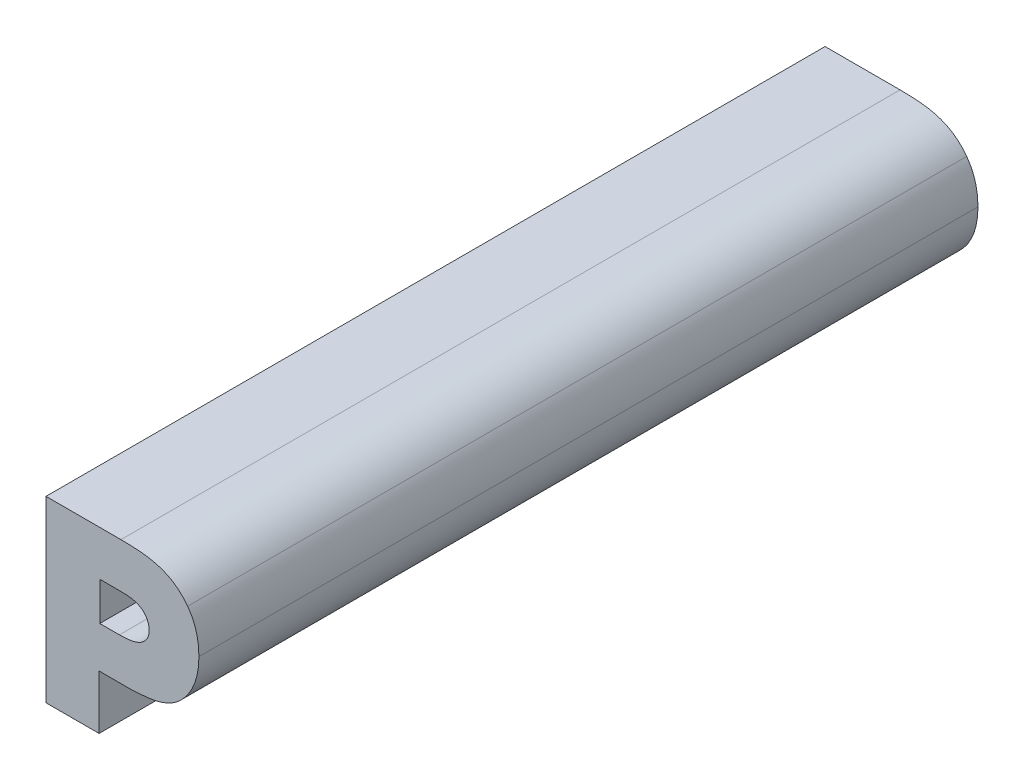
ISO-10303-21;
HEADER;
FILE_DESCRIPTION(('STEP AP214'),'2;1');
FILE_NAME('part.step','',(''),(''),'','','');
FILE_SCHEMA(('AUTOMOTIVE_DESIGN { 1 0 10303 214 1 1 1 1 }'));
ENDSEC;
DATA;
#1=APPLICATION_CONTEXT('core data for automotive mechanical design processes');
#2=APPLICATION_PROTOCOL_DEFINITION('international standard','automotive_design',2000,#1);
#3=PRODUCT_CONTEXT('',#1,'mechanical');
#4=PRODUCT('Part','Part','',(#3));
#5=PRODUCT_RELATED_PRODUCT_CATEGORY('part','',(#4));
#6=PRODUCT_DEFINITION_FORMATION('','',#4);
#7=PRODUCT_DEFINITION_CONTEXT('part definition',#1,'design');
#8=PRODUCT_DEFINITION('design','',#6,#7);
#9=PRODUCT_DEFINITION_SHAPE('','',#8);
#10=(LENGTH_UNIT() NAMED_UNIT(*) SI_UNIT(.MILLI.,.METRE.));
#11=(NAMED_UNIT(*) PLANE_ANGLE_UNIT() SI_UNIT($,.RADIAN.));
#12=(NAMED_UNIT(*) SI_UNIT($,.STERADIAN.) SOLID_ANGLE_UNIT());
#13=UNCERTAINTY_MEASURE_WITH_UNIT(LENGTH_MEASURE(1.E-05),#10,'distance_accuracy_value','');
#14=(GEOMETRIC_REPRESENTATION_CONTEXT(3) GLOBAL_UNCERTAINTY_ASSIGNED_CONTEXT((#13)) GLOBAL_UNIT_ASSIGNED_CONTEXT((#10,
#11,#12)) REPRESENTATION_CONTEXT('',''));
#15=CARTESIAN_POINT('',(0.,0.,0.));
#16=DIRECTION('',(0.,0.,1.));
#17=DIRECTION('',(1.,0.,0.));
#18=AXIS2_PLACEMENT_3D('',#15,#16,#17);
#19=CARTESIAN_POINT('',(1.3065440688273,0.0296655305136242,0.));
#20=DIRECTION('',(0.,-1.,0.));
#21=DIRECTION('',(1.,0.,0.));
#22=AXIS2_PLACEMENT_3D('',#19,#20,#21);
#23=PLANE('',#22);
#24=DIRECTION('',(1.,0.,0.));
#25=VECTOR('',#24,1.);
#26=CARTESIAN_POINT('',(1.3065592489997,0.0296655305136242,0.));
#27=LINE('',#26,#25);
#28=CARTESIAN_POINT('',(1.3065440688273,0.0296655305136242,0.));
#29=VERTEX_POINT('',#28);
#30=CARTESIAN_POINT('',(1.3090666836279,0.0296655305136242,0.));
#31=VERTEX_POINT('',#30);
#32=EDGE_CURVE('E11',#29,#31,#27,.T.);
#33=ORIENTED_EDGE('',*,*,#32,.F.);
#34=DIRECTION('',(0.,0.,1.));
#35=VECTOR('',#34,1.);
#36=CARTESIAN_POINT('',(1.3065440688273,0.0296655305136242,0.));
#37=LINE('',#36,#35);
#38=CARTESIAN_POINT('',(1.3065440688273,0.0296655305136242,0.1));
#39=VERTEX_POINT('',#38);
#40=EDGE_CURVE('E24',#29,#39,#37,.T.);
#41=ORIENTED_EDGE('',*,*,#40,.T.);
#42=DIRECTION('',(-1.,0.,0.));
#43=VECTOR('',#42,1.);
#44=CARTESIAN_POINT('',(1.3065592489997,0.0296655305136242,0.1));
#45=LINE('',#44,#43);
#46=CARTESIAN_POINT('',(1.3090666836279,0.0296655305136242,0.1));
#47=VERTEX_POINT('',#46);
#48=EDGE_CURVE('E342',#47,#39,#45,.T.);
#49=ORIENTED_EDGE('',*,*,#48,.F.);
#50=DIRECTION('',(0.,0.,1.));
#51=VECTOR('',#50,1.);
#52=CARTESIAN_POINT('',(1.3090666836279,0.0296655305136242,0.));
#53=LINE('',#52,#51);
#54=EDGE_CURVE('E339',#31,#47,#53,.T.);
#55=ORIENTED_EDGE('',*,*,#54,.F.);
#56=EDGE_LOOP('',(#33,#41,#49,#55));
#57=FACE_BOUND('',#56,.T.);
#58=ADVANCED_FACE('F17',(#57),#23,.F.);
#59=CARTESIAN_POINT('',(1.3065440688273,0.0345889686389742,0.));
#60=DIRECTION('',(-1.,0.,0.));
#61=DIRECTION('',(0.,-1.,0.));
#62=AXIS2_PLACEMENT_3D('',#59,#60,#61);
#63=PLANE('',#62);
#64=DIRECTION('',(0.,-1.,0.));
#65=VECTOR('',#64,1.);
#66=CARTESIAN_POINT('',(1.3065440688273,0.0319977137021068,0.));
#67=LINE('',#66,#65);
#68=CARTESIAN_POINT('',(1.3065440688273,0.0345889686389742,0.));
#69=VERTEX_POINT('',#68);
#70=EDGE_CURVE('E337',#69,#29,#67,.T.);
#71=ORIENTED_EDGE('',*,*,#70,.F.);
#72=DIRECTION('',(0.,0.,1.));
#73=VECTOR('',#72,1.);
#74=CARTESIAN_POINT('',(1.3065440688273,0.0345889686389742,0.));
#75=LINE('',#74,#73);
#76=CARTESIAN_POINT('',(1.3065440688273,0.0345889686389742,0.1));
#77=VERTEX_POINT('',#76);
#78=EDGE_CURVE('E335',#69,#77,#75,.T.);
#79=ORIENTED_EDGE('',*,*,#78,.T.);
#80=DIRECTION('',(0.,1.,0.));
#81=VECTOR('',#80,1.);
#82=CARTESIAN_POINT('',(1.3065440688273,0.0319977137021068,0.1));
#83=LINE('',#82,#81);
#84=EDGE_CURVE('E332',#39,#77,#83,.T.);
#85=ORIENTED_EDGE('',*,*,#84,.F.);
#86=ORIENTED_EDGE('',*,*,#40,.F.);
#87=EDGE_LOOP('',(#71,#79,#85,#86));
#88=FACE_BOUND('',#87,.T.);
#89=ADVANCED_FACE('F348',(#88),#63,.F.);
#90=CARTESIAN_POINT('',(1.3084287825669,0.0345889686389742,0.));
#91=DIRECTION('',(0.,1.,0.));
#92=DIRECTION('',(-1.,0.,0.));
#93=AXIS2_PLACEMENT_3D('',#90,#91,#92);
#94=PLANE('',#93);
#95=DIRECTION('',(-1.,0.,0.));
#96=VECTOR('',#95,1.);
#97=CARTESIAN_POINT('',(1.3075016058695,0.0345889686389742,0.));
#98=LINE('',#97,#96);
#99=CARTESIAN_POINT('',(1.3084287825669,0.0345889686389742,0.));
#100=VERTEX_POINT('',#99);
#101=EDGE_CURVE('E329',#100,#69,#98,.T.);
#102=ORIENTED_EDGE('',*,*,#101,.F.);
#103=DIRECTION('',(0.,0.,1.));
#104=VECTOR('',#103,1.);
#105=CARTESIAN_POINT('',(1.3084287825669,0.0345889686389742,0.));
#106=LINE('',#105,#104);
#107=CARTESIAN_POINT('',(1.3084287825669,0.0345889686389742,0.1));
#108=VERTEX_POINT('',#107);
#109=EDGE_CURVE('E327',#100,#108,#106,.T.);
#110=ORIENTED_EDGE('',*,*,#109,.T.);
#111=DIRECTION('',(1.,0.,0.));
#112=VECTOR('',#111,1.);
#113=CARTESIAN_POINT('',(1.3075016058695,0.0345889686389742,0.1));
#114=LINE('',#113,#112);
#115=EDGE_CURVE('E321',#77,#108,#114,.T.);
#116=ORIENTED_EDGE('',*,*,#115,.F.);
#117=ORIENTED_EDGE('',*,*,#78,.F.);
#118=EDGE_LOOP('',(#102,#110,#116,#117));
#119=FACE_BOUND('',#118,.T.);
#120=ADVANCED_FACE('F351',(#119),#94,.F.);
#121=CARTESIAN_POINT('',(1.3123141837369,0.0336408089062742,0.));
#122=CARTESIAN_POINT('',(1.3123141837369,0.0336408089062742,0.1));
#123=CARTESIAN_POINT('',(1.3113283357383,0.0347107441976205,0.));
#124=CARTESIAN_POINT('',(1.3113283357383,0.0347107441976205,0.1));
#125=CARTESIAN_POINT('',(1.3097335820909,0.0345889686389732,0.));
#126=CARTESIAN_POINT('',(1.3097335820909,0.0345889686389732,0.1));
#127=CARTESIAN_POINT('',(1.3084287825669,0.0345889686389742,0.));
#128=CARTESIAN_POINT('',(1.3084287825669,0.0345889686389742,0.1));
#129=B_SPLINE_SURFACE_WITH_KNOTS('',3,1,((#121,#122),(#123,#124),(#125,#126),(#127,#128)),
.UNSPECIFIED.,.F.,.F.,.F.,(4,4),(2,2),(0.,1.),(0.,0.01),.UNSPECIFIED.);
#130=CARTESIAN_POINT('',(1.3123141837369,0.0336408089062742,0.));
#131=CARTESIAN_POINT('',(1.3113283357383,0.0347107441976205,0.));
#132=CARTESIAN_POINT('',(1.3097335820909,0.0345889686389732,0.));
#133=CARTESIAN_POINT('',(1.3084287825669,0.0345889686389742,0.));
#134=B_SPLINE_CURVE_WITH_KNOTS('',3,(#130,#131,#132,#133),.UNSPECIFIED.,.F.,.F.,(4,4),(0.,1.),.UNSPECIFIED.);
#135=CARTESIAN_POINT('',(1.3123141837369,0.0336408089062742,0.));
#136=VERTEX_POINT('',#135);
#137=EDGE_CURVE('E316',#136,#100,#134,.T.);
#138=DIRECTION('',(0.,0.,1.));
#139=VECTOR('',#138,1.);
#140=CARTESIAN_POINT('',(1.3123141837369,0.0336408089062742,0.));
#141=LINE('',#140,#139);
#142=CARTESIAN_POINT('',(1.3123141837369,0.0336408089062742,0.1));
#143=VERTEX_POINT('',#142);
#144=EDGE_CURVE('E310',#136,#143,#141,.T.);
#145=CARTESIAN_POINT('',(1.3084287825669,0.0345889686389742,0.1));
#146=CARTESIAN_POINT('',(1.3097335820909,0.0345889686389732,0.1));
#147=CARTESIAN_POINT('',(1.3113283357383,0.0347107441976205,0.1));
#148=CARTESIAN_POINT('',(1.3123141837369,0.0336408089062742,0.1));
#149=B_SPLINE_CURVE_WITH_KNOTS('',3,(#145,#146,#147,#148),.UNSPECIFIED.,.F.,.F.,(4,4),(-1.,0.),.UNSPECIFIED.);
#150=EDGE_CURVE('E303',#108,#143,#149,.T.);
#151=ORIENTED_EDGE('',*,*,#137,.F.);
#152=ORIENTED_EDGE('',*,*,#144,.T.);
#153=ORIENTED_EDGE('',*,*,#150,.F.);
#154=ORIENTED_EDGE('',*,*,#109,.F.);
#155=EDGE_LOOP('',(#151,#152,#153,#154));
#156=FACE_BOUND('',#155,.T.);
#157=ADVANCED_FACE('F357',(#156),#129,.F.);
#158=CARTESIAN_POINT('',(1.3128940899939,0.0321127449062742,0.));
#159=CARTESIAN_POINT('',(1.3128940899939,0.0321127449062742,0.1));
#160=CARTESIAN_POINT('',(1.3128650925918,0.0329043218516245,0.));
#161=CARTESIAN_POINT('',(1.3128650925918,0.0329043218516245,0.1));
#162=CARTESIAN_POINT('',(1.3125171456542,0.0333972518199699,0.));
#163=CARTESIAN_POINT('',(1.3125171456542,0.0333972518199699,0.1));
#164=CARTESIAN_POINT('',(1.3123141837369,0.0336408089062742,0.));
#165=CARTESIAN_POINT('',(1.3123141837369,0.0336408089062742,0.1));
#166=B_SPLINE_SURFACE_WITH_KNOTS('',3,1,((#158,#159),(#160,#161),(#162,#163),(#164,#165)),
.UNSPECIFIED.,.F.,.F.,.F.,(4,4),(2,2),(0.,1.),(0.,0.01),.UNSPECIFIED.);
#167=CARTESIAN_POINT('',(1.3128940899939,0.0321127449062742,0.));
#168=CARTESIAN_POINT('',(1.3128650925918,0.0329043218516245,0.));
#169=CARTESIAN_POINT('',(1.3125171456542,0.0333972518199699,0.));
#170=CARTESIAN_POINT('',(1.3123141837369,0.0336408089062742,0.));
#171=B_SPLINE_CURVE_WITH_KNOTS('',3,(#167,#168,#169,#170),.UNSPECIFIED.,.F.,.F.,(4,4),(0.,1.),.UNSPECIFIED.);
#172=CARTESIAN_POINT('',(1.3128940899939,0.0321127449062742,0.));
#173=VERTEX_POINT('',#172);
#174=EDGE_CURVE('E298',#173,#136,#171,.T.);
#175=DIRECTION('',(0.,0.,1.));
#176=VECTOR('',#175,1.);
#177=CARTESIAN_POINT('',(1.3128940899939,0.0321127449062742,0.));
#178=LINE('',#177,#176);
#179=CARTESIAN_POINT('',(1.3128940899939,0.0321127449062742,0.1));
#180=VERTEX_POINT('',#179);
#181=EDGE_CURVE('E292',#173,#180,#178,.T.);
#182=CARTESIAN_POINT('',(1.3123141837369,0.0336408089062742,0.1));
#183=CARTESIAN_POINT('',(1.3125171456542,0.0333972518199699,0.1));
#184=CARTESIAN_POINT('',(1.3128650925918,0.0329043218516245,0.1));
#185=CARTESIAN_POINT('',(1.3128940899939,0.0321127449062742,0.1));
#186=B_SPLINE_CURVE_WITH_KNOTS('',3,(#182,#183,#184,#185),.UNSPECIFIED.,.F.,.F.,(4,4),(-1.,0.),.UNSPECIFIED.);
#187=EDGE_CURVE('E285',#143,#180,#186,.T.);
#188=ORIENTED_EDGE('',*,*,#174,.F.);
#189=ORIENTED_EDGE('',*,*,#181,.T.);
#190=ORIENTED_EDGE('',*,*,#187,.F.);
#191=ORIENTED_EDGE('',*,*,#144,.F.);
#192=EDGE_LOOP('',(#188,#189,#190,#191));
#193=FACE_BOUND('',#192,.T.);
#194=ADVANCED_FACE('F362',(#193),#166,.F.);
#195=CARTESIAN_POINT('',(1.3122851863349,0.0305817839516242,0.));
#196=CARTESIAN_POINT('',(1.3122851863349,0.0305817839516242,0.1));
#197=CARTESIAN_POINT('',(1.3125171456542,0.0308253470069703,0.));
#198=CARTESIAN_POINT('',(1.3125171456542,0.0308253470069703,0.1));
#199=CARTESIAN_POINT('',(1.312894089994,0.0313153720619738,0.));
#200=CARTESIAN_POINT('',(1.312894089994,0.0313153720619738,0.1));
#201=CARTESIAN_POINT('',(1.3128940899939,0.0321127449062742,0.));
#202=CARTESIAN_POINT('',(1.3128940899939,0.0321127449062742,0.1));
#203=B_SPLINE_SURFACE_WITH_KNOTS('',3,1,((#195,#196),(#197,#198),(#199,#200),(#201,#202)),
.UNSPECIFIED.,.F.,.F.,.F.,(4,4),(2,2),(0.,1.),(0.,0.01),.UNSPECIFIED.);
#204=CARTESIAN_POINT('',(1.3122851863349,0.0305817839516242,0.));
#205=CARTESIAN_POINT('',(1.3125171456542,0.0308253470069703,0.));
#206=CARTESIAN_POINT('',(1.312894089994,0.0313153720619738,0.));
#207=CARTESIAN_POINT('',(1.3128940899939,0.0321127449062742,0.));
#208=B_SPLINE_CURVE_WITH_KNOTS('',3,(#204,#205,#206,#207),.UNSPECIFIED.,.F.,.F.,(4,4),(0.,1.),.UNSPECIFIED.);
#209=CARTESIAN_POINT('',(1.3122851863349,0.0305817839516242,0.));
#210=VERTEX_POINT('',#209);
#211=EDGE_CURVE('E280',#210,#173,#208,.T.);
#212=DIRECTION('',(0.,0.,1.));
#213=VECTOR('',#212,1.);
#214=CARTESIAN_POINT('',(1.3122851863349,0.0305817839516242,0.));
#215=LINE('',#214,#213);
#216=CARTESIAN_POINT('',(1.3122851863349,0.0305817839516242,0.1));
#217=VERTEX_POINT('',#216);
#218=EDGE_CURVE('E274',#210,#217,#215,.T.);
#219=CARTESIAN_POINT('',(1.3128940899939,0.0321127449062742,0.1));
#220=CARTESIAN_POINT('',(1.312894089994,0.0313153720619738,0.1));
#221=CARTESIAN_POINT('',(1.3125171456542,0.0308253470069703,0.1));
#222=CARTESIAN_POINT('',(1.3122851863349,0.0305817839516242,0.1));
#223=B_SPLINE_CURVE_WITH_KNOTS('',3,(#219,#220,#221,#222),.UNSPECIFIED.,.F.,.F.,(4,4),(-1.,0.),.UNSPECIFIED.);
#224=EDGE_CURVE('E267',#180,#217,#223,.T.);
#225=ORIENTED_EDGE('',*,*,#211,.F.);
#226=ORIENTED_EDGE('',*,*,#218,.T.);
#227=ORIENTED_EDGE('',*,*,#224,.F.);
#228=ORIENTED_EDGE('',*,*,#181,.F.);
#229=EDGE_LOOP('',(#225,#226,#227,#228));
#230=FACE_BOUND('',#229,.T.);
#231=ADVANCED_FACE('F365',(#230),#203,.F.);
#232=CARTESIAN_POINT('',(1.3090666836279,0.0296655305136242,0.));
#233=CARTESIAN_POINT('',(1.3090666836279,0.0296655305136242,0.1));
#234=CARTESIAN_POINT('',(1.3101975047089,0.0296945219466252,0.));
#235=CARTESIAN_POINT('',(1.3101975047089,0.0296945219466252,0.1));
#236=CARTESIAN_POINT('',(1.3114733088206,0.0297554137052742,0.));
#237=CARTESIAN_POINT('',(1.3114733088206,0.0297554137052742,0.1));
#238=CARTESIAN_POINT('',(1.3122851863349,0.0305817839516242,0.));
#239=CARTESIAN_POINT('',(1.3122851863349,0.0305817839516242,0.1));
#240=B_SPLINE_SURFACE_WITH_KNOTS('',3,1,((#232,#233),(#234,#235),(#236,#237),(#238,#239)),
.UNSPECIFIED.,.F.,.F.,.F.,(4,4),(2,2),(0.,1.),(0.,0.01),.UNSPECIFIED.);
#241=CARTESIAN_POINT('',(1.3090666836279,0.0296655305136242,0.));
#242=CARTESIAN_POINT('',(1.3101975047089,0.0296945219466252,0.));
#243=CARTESIAN_POINT('',(1.3114733088206,0.0297554137052742,0.));
#244=CARTESIAN_POINT('',(1.3122851863349,0.0305817839516242,0.));
#245=B_SPLINE_CURVE_WITH_KNOTS('',3,(#241,#242,#243,#244),.UNSPECIFIED.,.F.,.F.,(4,4),(0.,1.),.UNSPECIFIED.);
#246=EDGE_CURVE('E260',#31,#210,#245,.T.);
#247=CARTESIAN_POINT('',(1.3122851863349,0.0305817839516242,0.1));
#248=CARTESIAN_POINT('',(1.3114733088206,0.0297554137052742,0.1));
#249=CARTESIAN_POINT('',(1.3101975047089,0.0296945219466252,0.1));
#250=CARTESIAN_POINT('',(1.3090666836279,0.0296655305136242,0.1));
#251=B_SPLINE_CURVE_WITH_KNOTS('',3,(#247,#248,#249,#250),.UNSPECIFIED.,.F.,.F.,(4,4),(-1.,0.),.UNSPECIFIED.);
#252=EDGE_CURVE('E252',#217,#47,#251,.T.);
#253=ORIENTED_EDGE('',*,*,#246,.F.);
#254=ORIENTED_EDGE('',*,*,#54,.T.);
#255=ORIENTED_EDGE('',*,*,#252,.F.);
#256=ORIENTED_EDGE('',*,*,#218,.F.);
#257=EDGE_LOOP('',(#253,#254,#255,#256));
#258=FACE_BOUND('',#257,.T.);
#259=ADVANCED_FACE('F368',(#258),#240,.F.);
#260=CARTESIAN_POINT('',(1.3192730986143,0.0323476111286242,0.));
#261=CARTESIAN_POINT('',(1.3192730986143,0.0323476111286242,0.1));
#262=CARTESIAN_POINT('',(1.3192730986143,0.0348876156159741,0.));
#263=CARTESIAN_POINT('',(1.3192730986143,0.0348876156159741,0.1));
#264=CARTESIAN_POINT('',(1.3184322336463,0.0364011868839721,0.));
#265=CARTESIAN_POINT('',(1.3184322336463,0.0364011868839721,0.1));
#266=CARTESIAN_POINT('',(1.3178233299873,0.0372246581859742,0.));
#267=CARTESIAN_POINT('',(1.3178233299873,0.0372246581859742,0.1));
#268=B_SPLINE_SURFACE_WITH_KNOTS('',3,1,((#260,#261),(#262,#263),(#264,#265),(#266,#267)),
.UNSPECIFIED.,.F.,.F.,.F.,(4,4),(2,2),(0.,1.),(0.,0.01),.UNSPECIFIED.);
#269=CARTESIAN_POINT('',(1.3192730986143,0.0323476111286242,0.));
#270=CARTESIAN_POINT('',(1.3192730986143,0.0348876156159741,0.));
#271=CARTESIAN_POINT('',(1.3184322336463,0.0364011868839721,0.));
#272=CARTESIAN_POINT('',(1.3178233299873,0.0372246581859742,0.));
#273=B_SPLINE_CURVE_WITH_KNOTS('',3,(#269,#270,#271,#272),.UNSPECIFIED.,.F.,.F.,(4,4),(0.,1.),.UNSPECIFIED.);
#274=CARTESIAN_POINT('',(1.3192730986143,0.0323476111286242,0.));
#275=VERTEX_POINT('',#274);
#276=CARTESIAN_POINT('',(1.3178233299873,0.0372246581859742,0.));
#277=VERTEX_POINT('',#276);
#278=EDGE_CURVE('E248',#275,#277,#273,.T.);
#279=DIRECTION('',(0.,0.,1.));
#280=VECTOR('',#279,1.);
#281=CARTESIAN_POINT('',(1.3178233299873,0.0372246581859742,0.));
#282=LINE('',#281,#280);
#283=CARTESIAN_POINT('',(1.3178233299873,0.0372246581859742,0.1));
#284=VERTEX_POINT('',#283);
#285=EDGE_CURVE('E243',#277,#284,#282,.T.);
#286=CARTESIAN_POINT('',(1.3192730986143,0.0323476111286242,0.1));
#287=CARTESIAN_POINT('',(1.3192730986143,0.0348876156159741,0.1));
#288=CARTESIAN_POINT('',(1.3184322336463,0.0364011868839721,0.1));
#289=CARTESIAN_POINT('',(1.3178233299873,0.0372246581859742,0.1));
#290=B_SPLINE_CURVE_WITH_KNOTS('',3,(#286,#287,#288,#289),.UNSPECIFIED.,.F.,.F.,(4,4),(0.,1.),.UNSPECIFIED.);
#291=CARTESIAN_POINT('',(1.3192730986143,0.0323476111286242,0.1));
#292=VERTEX_POINT('',#291);
#293=EDGE_CURVE('E152',#292,#284,#290,.T.);
#294=DIRECTION('',(0.,0.,1.));
#295=VECTOR('',#294,1.);
#296=CARTESIAN_POINT('',(1.3192730986143,0.0323476111286242,0.));
#297=LINE('',#296,#295);
#298=EDGE_CURVE('E234',#275,#292,#297,.T.);
#299=ORIENTED_EDGE('',*,*,#278,.T.);
#300=ORIENTED_EDGE('',*,*,#285,.T.);
#301=ORIENTED_EDGE('',*,*,#293,.F.);
#302=ORIENTED_EDGE('',*,*,#298,.F.);
#303=EDGE_LOOP('',(#299,#300,#301,#302));
#304=FACE_BOUND('',#303,.T.);
#305=ADVANCED_FACE('F370',(#304),#268,.T.);
#306=CARTESIAN_POINT('',(1.3169244702153,0.0263339431119617,0.));
#307=CARTESIAN_POINT('',(1.3169244702153,0.0263339431119617,0.1));
#308=CARTESIAN_POINT('',(1.3178813209197,0.0272299019206299,0.));
#309=CARTESIAN_POINT('',(1.3178813209197,0.0272299019206299,0.1));
#310=CARTESIAN_POINT('',(1.3192730986817,0.029152305945291,0.));
#311=CARTESIAN_POINT('',(1.3192730986817,0.029152305945291,0.1));
#312=CARTESIAN_POINT('',(1.3192730986143,0.0323476111286242,0.));
#313=CARTESIAN_POINT('',(1.3192730986143,0.0323476111286242,0.1));
#314=B_SPLINE_SURFACE_WITH_KNOTS('',3,1,((#306,#307),(#308,#309),(#310,#311),(#312,#313)),
.UNSPECIFIED.,.F.,.F.,.F.,(4,4),(2,2),(0.,1.),(0.,0.01),.UNSPECIFIED.);
#315=CARTESIAN_POINT('',(1.3169244702153,0.0263339431119617,0.));
#316=CARTESIAN_POINT('',(1.3178813209197,0.0272299019206299,0.));
#317=CARTESIAN_POINT('',(1.3192730986817,0.029152305945291,0.));
#318=CARTESIAN_POINT('',(1.3192730986143,0.0323476111286242,0.));
#319=B_SPLINE_CURVE_WITH_KNOTS('',3,(#315,#316,#317,#318),.UNSPECIFIED.,.F.,.F.,(4,4),(0.,1.),.UNSPECIFIED.);
#320=CARTESIAN_POINT('',(1.3169244702153,0.0263339431119617,0.));
#321=VERTEX_POINT('',#320);
#322=EDGE_CURVE('E226',#321,#275,#319,.T.);
#323=CARTESIAN_POINT('',(1.3169244702153,0.0263339431119617,0.1));
#324=CARTESIAN_POINT('',(1.3178813209197,0.0272299019206299,0.1));
#325=CARTESIAN_POINT('',(1.3192730986817,0.029152305945291,0.1));
#326=CARTESIAN_POINT('',(1.3192730986143,0.0323476111286242,0.1));
#327=B_SPLINE_CURVE_WITH_KNOTS('',3,(#323,#324,#325,#326),.UNSPECIFIED.,.F.,.F.,(4,4),(0.,1.),.UNSPECIFIED.);
#328=CARTESIAN_POINT('',(1.3169244702153,0.0263339431119617,0.1));
#329=VERTEX_POINT('',#328);
#330=EDGE_CURVE('E222',#329,#292,#327,.T.);
#331=DIRECTION('',(0.,0.,1.));
#332=VECTOR('',#331,1.);
#333=CARTESIAN_POINT('',(1.3169244702153,0.0263339431119617,0.));
#334=LINE('',#333,#332);
#335=EDGE_CURVE('E216',#321,#329,#334,.T.);
#336=ORIENTED_EDGE('',*,*,#322,.T.);
#337=ORIENTED_EDGE('',*,*,#298,.T.);
#338=ORIENTED_EDGE('',*,*,#330,.F.);
#339=ORIENTED_EDGE('',*,*,#335,.F.);
#340=EDGE_LOOP('',(#336,#337,#338,#339));
#341=FACE_BOUND('',#340,.T.);
#342=ADVANCED_FACE('F377',(#341),#314,.T.);
#343=CARTESIAN_POINT('',(1.3106614352856,0.0243419525146286,0.));
#344=CARTESIAN_POINT('',(1.3106614352856,0.0243419525146286,0.1));
#345=CARTESIAN_POINT('',(1.3129230873959,0.0244463344072979,0.));
#346=CARTESIAN_POINT('',(1.3129230873959,0.0244463344072979,0.1));
#347=CARTESIAN_POINT('',(1.3152137309393,0.0246203048916271,0.));
#348=CARTESIAN_POINT('',(1.3152137309393,0.0246203048916271,0.1));
#349=CARTESIAN_POINT('',(1.3169244702153,0.0263339431119617,0.));
#350=CARTESIAN_POINT('',(1.3169244702153,0.0263339431119617,0.1));
#351=B_SPLINE_SURFACE_WITH_KNOTS('',3,1,((#343,#344),(#345,#346),(#347,#348),(#349,#350)),
.UNSPECIFIED.,.F.,.F.,.F.,(4,4),(2,2),(0.,1.),(0.,0.01),.UNSPECIFIED.);
#352=CARTESIAN_POINT('',(1.3106614352856,0.0243419525146286,0.));
#353=CARTESIAN_POINT('',(1.3129230873959,0.0244463344072979,0.));
#354=CARTESIAN_POINT('',(1.3152137309393,0.0246203048916271,0.));
#355=CARTESIAN_POINT('',(1.3169244702153,0.0263339431119617,0.));
#356=B_SPLINE_CURVE_WITH_KNOTS('',3,(#352,#353,#354,#355),.UNSPECIFIED.,.F.,.F.,(4,4),(0.,1.),.UNSPECIFIED.);
#357=CARTESIAN_POINT('',(1.3106614352856,0.0243419525146286,0.));
#358=VERTEX_POINT('',#357);
#359=EDGE_CURVE('E208',#358,#321,#356,.T.);
#360=CARTESIAN_POINT('',(1.3106614352856,0.0243419525146286,0.1));
#361=CARTESIAN_POINT('',(1.3129230873959,0.0244463344072979,0.1));
#362=CARTESIAN_POINT('',(1.3152137309393,0.0246203048916271,0.1));
#363=CARTESIAN_POINT('',(1.3169244702153,0.0263339431119617,0.1));
#364=B_SPLINE_CURVE_WITH_KNOTS('',3,(#360,#361,#362,#363),.UNSPECIFIED.,.F.,.F.,(4,4),(0.,1.),.UNSPECIFIED.);
#365=CARTESIAN_POINT('',(1.3106614352856,0.0243419525146286,0.1));
#366=VERTEX_POINT('',#365);
#367=EDGE_CURVE('E203',#366,#329,#364,.T.);
#368=DIRECTION('',(0.,0.,1.));
#369=VECTOR('',#368,1.);
#370=CARTESIAN_POINT('',(1.3106614352856,0.0243419525146286,0.));
#371=LINE('',#370,#369);
#372=EDGE_CURVE('E200',#358,#366,#371,.T.);
#373=ORIENTED_EDGE('',*,*,#359,.T.);
#374=ORIENTED_EDGE('',*,*,#335,.T.);
#375=ORIENTED_EDGE('',*,*,#367,.F.);
#376=ORIENTED_EDGE('',*,*,#372,.F.);
#377=EDGE_LOOP('',(#373,#374,#375,#376));
#378=FACE_BOUND('',#377,.T.);
#379=ADVANCED_FACE('F451',(#378),#351,.T.);
#380=CARTESIAN_POINT('',(1.3064570865696,0.0243419525146286,0.));
#381=DIRECTION('',(0.,-1.,0.));
#382=DIRECTION('',(1.,0.,0.));
#383=AXIS2_PLACEMENT_3D('',#380,#381,#382);
#384=PLANE('',#383);
#385=DIRECTION('',(1.,0.,0.));
#386=VECTOR('',#385,1.);
#387=CARTESIAN_POINT('',(1.3064570865696,0.0243419525146286,0.));
#388=LINE('',#387,#386);
#389=CARTESIAN_POINT('',(1.3064570865696,0.0243419525146286,0.));
#390=VERTEX_POINT('',#389);
#391=EDGE_CURVE('E197',#390,#358,#388,.T.);
#392=ORIENTED_EDGE('',*,*,#391,.T.);
#393=ORIENTED_EDGE('',*,*,#372,.T.);
#394=DIRECTION('',(1.,0.,0.));
#395=VECTOR('',#394,1.);
#396=CARTESIAN_POINT('',(1.3064570865696,0.0243419525146286,0.1));
#397=LINE('',#396,#395);
#398=CARTESIAN_POINT('',(1.3064570865696,0.0243419525146286,0.1));
#399=VERTEX_POINT('',#398);
#400=EDGE_CURVE('E194',#399,#366,#397,.T.);
#401=ORIENTED_EDGE('',*,*,#400,.F.);
#402=DIRECTION('',(0.,0.,1.));
#403=VECTOR('',#402,1.);
#404=CARTESIAN_POINT('',(1.3064570865696,0.0243419525146286,0.));
#405=LINE('',#404,#403);
#406=EDGE_CURVE('E191',#390,#399,#405,.T.);
#407=ORIENTED_EDGE('',*,*,#406,.F.);
#408=EDGE_LOOP('',(#392,#393,#401,#407));
#409=FACE_BOUND('',#408,.T.);
#410=ADVANCED_FACE('F461',(#409),#384,.T.);
#411=CARTESIAN_POINT('',(1.3064570865696,0.0173975244002742,0.));
#412=DIRECTION('',(1.,0.,0.));
#413=DIRECTION('',(0.,1.,0.));
#414=AXIS2_PLACEMENT_3D('',#411,#412,#413);
#415=PLANE('',#414);
#416=DIRECTION('',(0.,1.,0.));
#417=VECTOR('',#416,1.);
#418=CARTESIAN_POINT('',(1.3064570865696,0.0173975244002742,0.));
#419=LINE('',#418,#417);
#420=CARTESIAN_POINT('',(1.3064570865696,0.0173975244002742,0.));
#421=VERTEX_POINT('',#420);
#422=EDGE_CURVE('E188',#421,#390,#419,.T.);
#423=ORIENTED_EDGE('',*,*,#422,.T.);
#424=ORIENTED_EDGE('',*,*,#406,.T.);
#425=DIRECTION('',(0.,1.,0.));
#426=VECTOR('',#425,1.);
#427=CARTESIAN_POINT('',(1.3064570865696,0.0173975244002742,0.1));
#428=LINE('',#427,#426);
#429=CARTESIAN_POINT('',(1.3064570865696,0.0173975244002742,0.1));
#430=VERTEX_POINT('',#429);
#431=EDGE_CURVE('E185',#430,#399,#428,.T.);
#432=ORIENTED_EDGE('',*,*,#431,.F.);
#433=DIRECTION('',(0.,0.,1.));
#434=VECTOR('',#433,1.);
#435=CARTESIAN_POINT('',(1.3064570865696,0.0173975244002742,0.));
#436=LINE('',#435,#434);
#437=EDGE_CURVE('E182',#421,#430,#436,.T.);
#438=ORIENTED_EDGE('',*,*,#437,.F.);
#439=EDGE_LOOP('',(#423,#424,#432,#438));
#440=FACE_BOUND('',#439,.T.);
#441=ADVANCED_FACE('F471',(#440),#415,.T.);
#442=CARTESIAN_POINT('',(1.2996431427849,0.0173975244002742,0.));
#443=DIRECTION('',(0.,-1.,0.));
#444=DIRECTION('',(1.,0.,0.));
#445=AXIS2_PLACEMENT_3D('',#442,#443,#444);
#446=PLANE('',#445);
#447=DIRECTION('',(1.,0.,0.));
#448=VECTOR('',#447,1.);
#449=CARTESIAN_POINT('',(1.2996431427849,0.0173975244002742,0.));
#450=LINE('',#449,#448);
#451=CARTESIAN_POINT('',(1.2996431427849,0.0173975244002742,0.));
#452=VERTEX_POINT('',#451);
#453=EDGE_CURVE('E179',#452,#421,#450,.T.);
#454=ORIENTED_EDGE('',*,*,#453,.T.);
#455=ORIENTED_EDGE('',*,*,#437,.T.);
#456=DIRECTION('',(1.,0.,0.));
#457=VECTOR('',#456,1.);
#458=CARTESIAN_POINT('',(1.2996431427849,0.0173975244002742,0.1));
#459=LINE('',#458,#457);
#460=CARTESIAN_POINT('',(1.2996431427849,0.0173975244002742,0.1));
#461=VERTEX_POINT('',#460);
#462=EDGE_CURVE('E176',#461,#430,#459,.T.);
#463=ORIENTED_EDGE('',*,*,#462,.F.);
#464=DIRECTION('',(0.,0.,1.));
#465=VECTOR('',#464,1.);
#466=CARTESIAN_POINT('',(1.2996431427849,0.0173975244002742,0.));
#467=LINE('',#466,#465);
#468=EDGE_CURVE('E173',#452,#461,#467,.T.);
#469=ORIENTED_EDGE('',*,*,#468,.F.);
#470=EDGE_LOOP('',(#454,#455,#463,#469));
#471=FACE_BOUND('',#470,.T.);
#472=ADVANCED_FACE('F481',(#471),#446,.T.);
#473=CARTESIAN_POINT('',(1.2996431427849,0.0403503707982742,0.));
#474=DIRECTION('',(-1.,0.,0.));
#475=DIRECTION('',(0.,-1.,0.));
#476=AXIS2_PLACEMENT_3D('',#473,#474,#475);
#477=PLANE('',#476);
#478=DIRECTION('',(0.,-1.,0.));
#479=VECTOR('',#478,1.);
#480=CARTESIAN_POINT('',(1.2996431427849,0.0403503707982742,0.));
#481=LINE('',#480,#479);
#482=CARTESIAN_POINT('',(1.2996431427849,0.0403503707982742,0.));
#483=VERTEX_POINT('',#482);
#484=EDGE_CURVE('E170',#483,#452,#481,.T.);
#485=ORIENTED_EDGE('',*,*,#484,.T.);
#486=ORIENTED_EDGE('',*,*,#468,.T.);
#487=DIRECTION('',(0.,-1.,0.));
#488=VECTOR('',#487,1.);
#489=CARTESIAN_POINT('',(1.2996431427849,0.0403503707982742,0.1));
#490=LINE('',#489,#488);
#491=CARTESIAN_POINT('',(1.2996431427849,0.0403503707982742,0.1));
#492=VERTEX_POINT('',#491);
#493=EDGE_CURVE('E168',#492,#461,#490,.T.);
#494=ORIENTED_EDGE('',*,*,#493,.F.);
#495=DIRECTION('',(0.,0.,1.));
#496=VECTOR('',#495,1.);
#497=CARTESIAN_POINT('',(1.2996431427849,0.0403503707982742,0.));
#498=LINE('',#497,#496);
#499=EDGE_CURVE('E134',#483,#492,#498,.T.);
#500=ORIENTED_EDGE('',*,*,#499,.F.);
#501=EDGE_LOOP('',(#485,#486,#494,#500));
#502=FACE_BOUND('',#501,.T.);
#503=ADVANCED_FACE('F491',(#502),#477,.T.);
#504=CARTESIAN_POINT('',(1.3092696515143,0.0403503707982742,0.));
#505=DIRECTION('',(0.,1.,0.));
#506=DIRECTION('',(-1.,0.,0.));
#507=AXIS2_PLACEMENT_3D('',#504,#505,#506);
#508=PLANE('',#507);
#509=DIRECTION('',(-1.,0.,0.));
#510=VECTOR('',#509,1.);
#511=CARTESIAN_POINT('',(1.3092696515143,0.0403503707982742,0.));
#512=LINE('',#511,#510);
#513=CARTESIAN_POINT('',(1.3092696515143,0.0403503707982742,0.));
#514=VERTEX_POINT('',#513);
#515=EDGE_CURVE('E138',#514,#483,#512,.T.);
#516=ORIENTED_EDGE('',*,*,#515,.T.);
#517=ORIENTED_EDGE('',*,*,#499,.T.);
#518=DIRECTION('',(-1.,0.,0.));
#519=VECTOR('',#518,1.);
#520=CARTESIAN_POINT('',(1.3092696515143,0.0403503707982742,0.1));
#521=LINE('',#520,#519);
#522=CARTESIAN_POINT('',(1.3092696515143,0.0403503707982742,0.1));
#523=VERTEX_POINT('',#522);
#524=EDGE_CURVE('E127',#523,#492,#521,.T.);
#525=ORIENTED_EDGE('',*,*,#524,.F.);
#526=DIRECTION('',(0.,0.,1.));
#527=VECTOR('',#526,1.);
#528=CARTESIAN_POINT('',(1.3092696515143,0.0403503707982742,0.));
#529=LINE('',#528,#527);
#530=EDGE_CURVE('E131',#514,#523,#529,.T.);
#531=ORIENTED_EDGE('',*,*,#530,.F.);
#532=EDGE_LOOP('',(#516,#517,#525,#531));
#533=FACE_BOUND('',#532,.T.);
#534=ADVANCED_FACE('F130',(#533),#508,.T.);
#535=CARTESIAN_POINT('',(1.3178233299873,0.0372246581859742,0.));
#536=CARTESIAN_POINT('',(1.3178233299873,0.0372246581859742,0.1));
#537=CARTESIAN_POINT('',(1.3156486601346,0.0401445059572784,0.));
#538=CARTESIAN_POINT('',(1.3156486601346,0.0401445059572784,0.1));
#539=CARTESIAN_POINT('',(1.3125171456542,0.0403155814766279,0.));
#540=CARTESIAN_POINT('',(1.3125171456542,0.0403155814766279,0.1));
#541=CARTESIAN_POINT('',(1.3092696515143,0.0403503707982742,0.));
#542=CARTESIAN_POINT('',(1.3092696515143,0.0403503707982742,0.1));
#543=B_SPLINE_SURFACE_WITH_KNOTS('',3,1,((#535,#536),(#537,#538),(#539,#540),(#541,#542)),
.UNSPECIFIED.,.F.,.F.,.F.,(4,4),(2,2),(0.,1.),(0.,0.01),.UNSPECIFIED.);
#544=CARTESIAN_POINT('',(1.3178233299873,0.0372246581859742,0.));
#545=CARTESIAN_POINT('',(1.3156486601346,0.0401445059572784,0.));
#546=CARTESIAN_POINT('',(1.3125171456542,0.0403155814766279,0.));
#547=CARTESIAN_POINT('',(1.3092696515143,0.0403503707982742,0.));
#548=B_SPLINE_CURVE_WITH_KNOTS('',3,(#544,#545,#546,#547),.UNSPECIFIED.,.F.,.F.,(4,4),(0.,1.),.UNSPECIFIED.);
#549=EDGE_CURVE('E146',#277,#514,#548,.T.);
#550=CARTESIAN_POINT('',(1.3178233299873,0.0372246581859742,0.1));
#551=CARTESIAN_POINT('',(1.3156486601346,0.0401445059572784,0.1));
#552=CARTESIAN_POINT('',(1.3125171456542,0.0403155814766279,0.1));
#553=CARTESIAN_POINT('',(1.3092696515143,0.0403503707982742,0.1));
#554=B_SPLINE_CURVE_WITH_KNOTS('',3,(#550,#551,#552,#553),.UNSPECIFIED.,.F.,.F.,(4,4),(0.,1.),.UNSPECIFIED.);
#555=EDGE_CURVE('E144',#284,#523,#554,.T.);
#556=ORIENTED_EDGE('',*,*,#549,.T.);
#557=ORIENTED_EDGE('',*,*,#530,.T.);
#558=ORIENTED_EDGE('',*,*,#555,.F.);
#559=ORIENTED_EDGE('',*,*,#285,.F.);
#560=EDGE_LOOP('',(#556,#557,#558,#559));
#561=FACE_BOUND('',#560,.T.);
#562=ADVANCED_FACE('F142',(#561),#543,.T.);
#563=CARTESIAN_POINT('',(1.3065744291721,0.0294064587652395,0.1));
#564=DIRECTION('',(0.,0.,1.));
#565=DIRECTION('',(1.,0.,0.));
#566=AXIS2_PLACEMENT_3D('',#563,#564,#565);
#567=PLANE('',#566);
#568=ORIENTED_EDGE('',*,*,#555,.T.);
#569=ORIENTED_EDGE('',*,*,#524,.T.);
#570=ORIENTED_EDGE('',*,*,#493,.T.);
#571=ORIENTED_EDGE('',*,*,#462,.T.);
#572=ORIENTED_EDGE('',*,*,#431,.T.);
#573=ORIENTED_EDGE('',*,*,#400,.T.);
#574=ORIENTED_EDGE('',*,*,#367,.T.);
#575=ORIENTED_EDGE('',*,*,#330,.T.);
#576=ORIENTED_EDGE('',*,*,#293,.T.);
#577=EDGE_LOOP('',(#568,#569,#570,#571,#572,#573,#574,#575,#576));
#578=FACE_BOUND('',#577,.T.);
#579=ORIENTED_EDGE('',*,*,#48,.T.);
#580=ORIENTED_EDGE('',*,*,#84,.T.);
#581=ORIENTED_EDGE('',*,*,#115,.T.);
#582=ORIENTED_EDGE('',*,*,#150,.T.);
#583=ORIENTED_EDGE('',*,*,#187,.T.);
#584=ORIENTED_EDGE('',*,*,#224,.T.);
#585=ORIENTED_EDGE('',*,*,#252,.T.);
#586=EDGE_LOOP('',(#579,#580,#581,#582,#583,#584,#585));
#587=FACE_BOUND('',#586,.T.);
#588=ADVANCED_FACE('F149',(#578,#587),#567,.T.);
#589=CARTESIAN_POINT('',(1.3065744291721,0.0294064587652395,0.));
#590=DIRECTION('',(0.,0.,1.));
#591=DIRECTION('',(1.,0.,0.));
#592=AXIS2_PLACEMENT_3D('',#589,#590,#591);
#593=PLANE('',#592);
#594=ORIENTED_EDGE('',*,*,#549,.F.);
#595=ORIENTED_EDGE('',*,*,#278,.F.);
#596=ORIENTED_EDGE('',*,*,#322,.F.);
#597=ORIENTED_EDGE('',*,*,#359,.F.);
#598=ORIENTED_EDGE('',*,*,#391,.F.);
#599=ORIENTED_EDGE('',*,*,#422,.F.);
#600=ORIENTED_EDGE('',*,*,#453,.F.);
#601=ORIENTED_EDGE('',*,*,#484,.F.);
#602=ORIENTED_EDGE('',*,*,#515,.F.);
#603=EDGE_LOOP('',(#594,#595,#596,#597,#598,#599,#600,#601,#602));
#604=FACE_BOUND('',#603,.T.);
#605=ORIENTED_EDGE('',*,*,#32,.T.);
#606=ORIENTED_EDGE('',*,*,#246,.T.);
#607=ORIENTED_EDGE('',*,*,#211,.T.);
#608=ORIENTED_EDGE('',*,*,#174,.T.);
#609=ORIENTED_EDGE('',*,*,#137,.T.);
#610=ORIENTED_EDGE('',*,*,#101,.T.);
#611=ORIENTED_EDGE('',*,*,#70,.T.);
#612=EDGE_LOOP('',(#605,#606,#607,#608,#609,#610,#611));
#613=FACE_BOUND('',#612,.T.);
#614=ADVANCED_FACE('F353',(#604,#613),#593,.F.);
#615=CLOSED_SHELL('',(#58,#89,#120,#157,#194,#231,#259,#305,#342,#379,#410,#441,#472,#503,#534,
#562,#588,#614));
#616=MANIFOLD_SOLID_BREP('B1',#615);
#617=ADVANCED_BREP_SHAPE_REPRESENTATION('',(#18,#616),#14);
#618=SHAPE_DEFINITION_REPRESENTATION(#9,#617);
ENDSEC;
END-ISO-10303-21;
